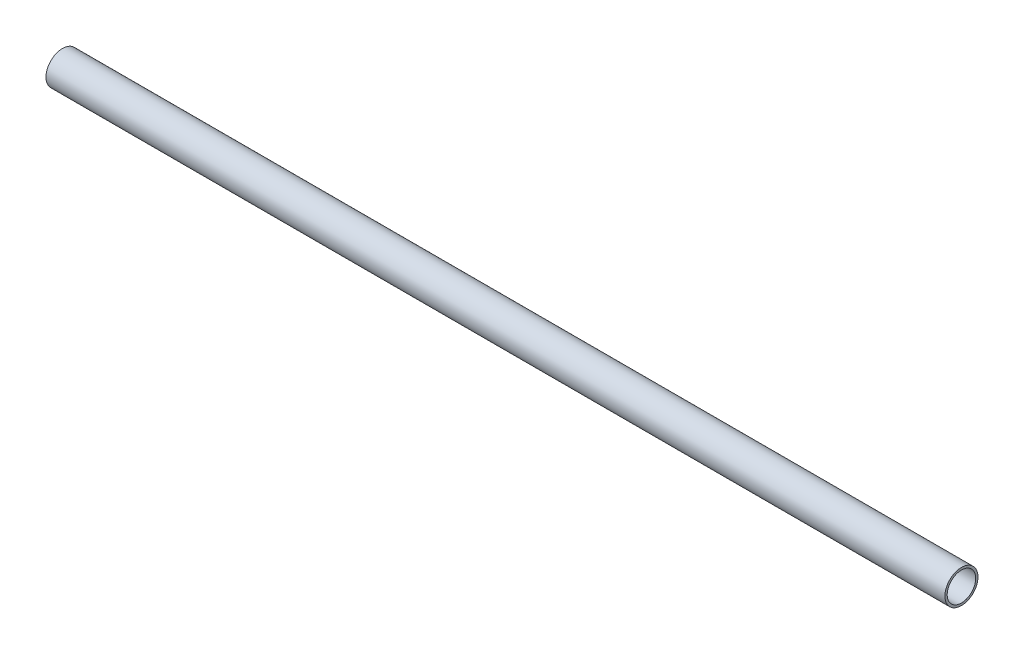
ISO-10303-21;
HEADER;
FILE_DESCRIPTION(('STEP AP214'),'2;1');
FILE_NAME('part.step','',(''),(''),'','','');
FILE_SCHEMA(('AUTOMOTIVE_DESIGN { 1 0 10303 214 1 1 1 1 }'));
ENDSEC;
DATA;
#1=APPLICATION_CONTEXT('core data for automotive mechanical design processes');
#2=APPLICATION_PROTOCOL_DEFINITION('international standard','automotive_design',2000,#1);
#3=PRODUCT_CONTEXT('',#1,'mechanical');
#4=PRODUCT('Part','Part','',(#3));
#5=PRODUCT_RELATED_PRODUCT_CATEGORY('part','',(#4));
#6=PRODUCT_DEFINITION_FORMATION('','',#4);
#7=PRODUCT_DEFINITION_CONTEXT('part definition',#1,'design');
#8=PRODUCT_DEFINITION('design','',#6,#7);
#9=PRODUCT_DEFINITION_SHAPE('','',#8);
#10=(LENGTH_UNIT() NAMED_UNIT(*) SI_UNIT(.MILLI.,.METRE.));
#11=(NAMED_UNIT(*) PLANE_ANGLE_UNIT() SI_UNIT($,.RADIAN.));
#12=(NAMED_UNIT(*) SI_UNIT($,.STERADIAN.) SOLID_ANGLE_UNIT());
#13=UNCERTAINTY_MEASURE_WITH_UNIT(LENGTH_MEASURE(1.E-05),#10,'distance_accuracy_value','');
#14=(GEOMETRIC_REPRESENTATION_CONTEXT(3) GLOBAL_UNCERTAINTY_ASSIGNED_CONTEXT((#13)) GLOBAL_UNIT_ASSIGNED_CONTEXT((#10,
#11,#12)) REPRESENTATION_CONTEXT('',''));
#15=CARTESIAN_POINT('',(0.,0.,0.));
#16=DIRECTION('',(0.,0.,1.));
#17=DIRECTION('',(1.,0.,0.));
#18=AXIS2_PLACEMENT_3D('',#15,#16,#17);
#19=CARTESIAN_POINT('',(40.,0.,0.));
#20=DIRECTION('',(1.,0.,0.));
#21=DIRECTION('',(0.,0.,-1.));
#22=AXIS2_PLACEMENT_3D('',#19,#20,#21);
#23=PLANE('',#22);
#24=CARTESIAN_POINT('',(40.,0.,0.));
#25=DIRECTION('',(1.,0.,0.));
#26=DIRECTION('',(0.,0.,-1.));
#27=AXIS2_PLACEMENT_3D('',#24,#25,#26);
#28=CIRCLE('',#27,0.7366);
#29=CARTESIAN_POINT('',(40.,0.,-0.7366));
#30=VERTEX_POINT('',#29);
#31=EDGE_CURVE('E10',#30,#30,#28,.T.);
#32=ORIENTED_EDGE('',*,*,#31,.T.);
#33=EDGE_LOOP('',(#32));
#34=FACE_BOUND('',#33,.T.);
#35=CARTESIAN_POINT('',(40.,0.,0.));
#36=DIRECTION('',(1.,0.,0.));
#37=DIRECTION('',(0.,0.,-1.));
#38=AXIS2_PLACEMENT_3D('',#35,#36,#37);
#39=CIRCLE('',#38,0.635);
#40=CARTESIAN_POINT('',(40.,0.,-0.635));
#41=VERTEX_POINT('',#40);
#42=EDGE_CURVE('E42',#41,#41,#39,.T.);
#43=ORIENTED_EDGE('',*,*,#42,.F.);
#44=EDGE_LOOP('',(#43));
#45=FACE_BOUND('',#44,.T.);
#46=ADVANCED_FACE('F31',(#34,#45),#23,.T.);
#47=CARTESIAN_POINT('',(0.,0.,0.));
#48=DIRECTION('',(1.,0.,0.));
#49=DIRECTION('',(0.,0.,-1.));
#50=AXIS2_PLACEMENT_3D('',#47,#48,#49);
#51=PLANE('',#50);
#52=CARTESIAN_POINT('',(0.,0.,0.));
#53=DIRECTION('',(1.,0.,0.));
#54=DIRECTION('',(0.,0.,-1.));
#55=AXIS2_PLACEMENT_3D('',#52,#53,#54);
#56=CIRCLE('',#55,0.7366);
#57=CARTESIAN_POINT('',(0.,0.,-0.7366));
#58=VERTEX_POINT('',#57);
#59=EDGE_CURVE('E35',#58,#58,#56,.T.);
#60=ORIENTED_EDGE('',*,*,#59,.F.);
#61=EDGE_LOOP('',(#60));
#62=FACE_BOUND('',#61,.T.);
#63=CARTESIAN_POINT('',(0.,0.,0.));
#64=DIRECTION('',(1.,0.,0.));
#65=DIRECTION('',(0.,0.,-1.));
#66=AXIS2_PLACEMENT_3D('',#63,#64,#65);
#67=CIRCLE('',#66,0.635);
#68=CARTESIAN_POINT('',(0.,0.,-0.635));
#69=VERTEX_POINT('',#68);
#70=EDGE_CURVE('E44',#69,#69,#67,.T.);
#71=ORIENTED_EDGE('',*,*,#70,.T.);
#72=EDGE_LOOP('',(#71));
#73=FACE_BOUND('',#72,.T.);
#74=ADVANCED_FACE('F54',(#62,#73),#51,.F.);
#75=CARTESIAN_POINT('',(40.,0.,0.));
#76=DIRECTION('',(-1.,0.,0.));
#77=DIRECTION('',(0.,0.,1.));
#78=AXIS2_PLACEMENT_3D('',#75,#76,#77);
#79=CYLINDRICAL_SURFACE('',#78,0.7366);
#80=ORIENTED_EDGE('',*,*,#31,.F.);
#81=EDGE_LOOP('',(#80));
#82=FACE_BOUND('',#81,.T.);
#83=ORIENTED_EDGE('',*,*,#59,.T.);
#84=EDGE_LOOP('',(#83));
#85=FACE_BOUND('',#84,.T.);
#86=ADVANCED_FACE('F33',(#82,#85),#79,.T.);
#87=CARTESIAN_POINT('',(40.,0.,0.));
#88=DIRECTION('',(-1.,0.,0.));
#89=DIRECTION('',(0.,0.,1.));
#90=AXIS2_PLACEMENT_3D('',#87,#88,#89);
#91=CYLINDRICAL_SURFACE('',#90,0.635);
#92=ORIENTED_EDGE('',*,*,#42,.T.);
#93=EDGE_LOOP('',(#92));
#94=FACE_BOUND('',#93,.T.);
#95=ORIENTED_EDGE('',*,*,#70,.F.);
#96=EDGE_LOOP('',(#95));
#97=FACE_BOUND('',#96,.T.);
#98=ADVANCED_FACE('F50',(#94,#97),#91,.F.);
#99=CLOSED_SHELL('',(#46,#74,#86,#98));
#100=MANIFOLD_SOLID_BREP('B2',#99);
#101=ADVANCED_BREP_SHAPE_REPRESENTATION('',(#18,#100),#14);
#102=SHAPE_DEFINITION_REPRESENTATION(#9,#101);
ENDSEC;
END-ISO-10303-21;
